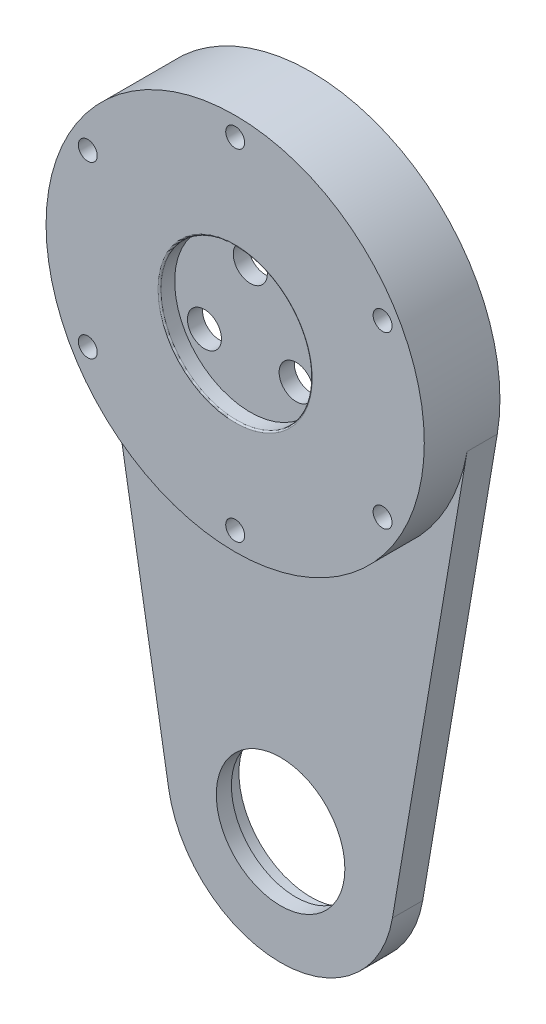
ISO-10303-21;
HEADER;
FILE_DESCRIPTION(('STEP AP214'),'2;1');
FILE_NAME('part.step','',(''),(''),'','','');
FILE_SCHEMA(('AUTOMOTIVE_DESIGN { 1 0 10303 214 1 1 1 1 }'));
ENDSEC;
DATA;
#1=APPLICATION_CONTEXT('core data for automotive mechanical design processes');
#2=APPLICATION_PROTOCOL_DEFINITION('international standard','automotive_design',2000,#1);
#3=PRODUCT_CONTEXT('',#1,'mechanical');
#4=PRODUCT('Part','Part','',(#3));
#5=PRODUCT_RELATED_PRODUCT_CATEGORY('part','',(#4));
#6=PRODUCT_DEFINITION_FORMATION('','',#4);
#7=PRODUCT_DEFINITION_CONTEXT('part definition',#1,'design');
#8=PRODUCT_DEFINITION('design','',#6,#7);
#9=PRODUCT_DEFINITION_SHAPE('','',#8);
#10=(LENGTH_UNIT() NAMED_UNIT(*) SI_UNIT(.MILLI.,.METRE.));
#11=(NAMED_UNIT(*) PLANE_ANGLE_UNIT() SI_UNIT($,.RADIAN.));
#12=(NAMED_UNIT(*) SI_UNIT($,.STERADIAN.) SOLID_ANGLE_UNIT());
#13=UNCERTAINTY_MEASURE_WITH_UNIT(LENGTH_MEASURE(1.E-05),#10,'distance_accuracy_value','');
#14=(GEOMETRIC_REPRESENTATION_CONTEXT(3) GLOBAL_UNCERTAINTY_ASSIGNED_CONTEXT((#13)) GLOBAL_UNIT_ASSIGNED_CONTEXT((#10,
#11,#12)) REPRESENTATION_CONTEXT('',''));
#15=CARTESIAN_POINT('',(0.,0.,0.));
#16=DIRECTION('',(0.,0.,1.));
#17=DIRECTION('',(1.,0.,0.));
#18=AXIS2_PLACEMENT_3D('',#15,#16,#17);
#19=CARTESIAN_POINT('',(-35.5676389386564,-176.5,-10.));
#20=DIRECTION('',(0.,0.,1.));
#21=DIRECTION('',(1.,0.,0.));
#22=AXIS2_PLACEMENT_3D('',#19,#20,#21);
#23=PLANE('',#22);
#24=CARTESIAN_POINT('',(-19.4855715851498,11.2500000000002,-10.));
#25=DIRECTION('',(0.,0.,-1.));
#26=DIRECTION('',(-1.,0.,0.));
#27=AXIS2_PLACEMENT_3D('',#24,#25,#26);
#28=CIRCLE('',#27,1.24999999999997);
#29=CARTESIAN_POINT('',(-20.7355715851497,11.2500000000002,-10.));
#30=VERTEX_POINT('',#29);
#31=EDGE_CURVE('E515',#30,#30,#28,.T.);
#32=ORIENTED_EDGE('',*,*,#31,.F.);
#33=EDGE_LOOP('',(#32));
#34=FACE_BOUND('',#33,.T.);
#35=CARTESIAN_POINT('',(-19.48557158515,-11.2499999999998,-10.));
#36=DIRECTION('',(0.,0.,-1.));
#37=DIRECTION('',(-1.,0.,0.));
#38=AXIS2_PLACEMENT_3D('',#35,#36,#37);
#39=CIRCLE('',#38,1.24999999999997);
#40=CARTESIAN_POINT('',(-20.73557158515,-11.2499999999998,-10.));
#41=VERTEX_POINT('',#40);
#42=EDGE_CURVE('E520',#41,#41,#39,.T.);
#43=ORIENTED_EDGE('',*,*,#42,.F.);
#44=EDGE_LOOP('',(#43));
#45=FACE_BOUND('',#44,.T.);
#46=CARTESIAN_POINT('',(19.4855715851499,11.25,-10.));
#47=DIRECTION('',(0.,0.,-1.));
#48=DIRECTION('',(-1.,0.,0.));
#49=AXIS2_PLACEMENT_3D('',#46,#47,#48);
#50=CIRCLE('',#49,1.24999999999997);
#51=CARTESIAN_POINT('',(18.2355715851499,11.25,-10.));
#52=VERTEX_POINT('',#51);
#53=EDGE_CURVE('E544',#52,#52,#50,.T.);
#54=ORIENTED_EDGE('',*,*,#53,.F.);
#55=EDGE_LOOP('',(#54));
#56=FACE_BOUND('',#55,.T.);
#57=CARTESIAN_POINT('',(0.,22.5,-10.));
#58=DIRECTION('',(0.,0.,-1.));
#59=DIRECTION('',(-1.,0.,0.));
#60=AXIS2_PLACEMENT_3D('',#57,#58,#59);
#61=CIRCLE('',#60,1.24999999999997);
#62=CARTESIAN_POINT('',(-1.24999999999997,22.5,-10.));
#63=VERTEX_POINT('',#62);
#64=EDGE_CURVE('E551',#63,#63,#61,.T.);
#65=ORIENTED_EDGE('',*,*,#64,.F.);
#66=EDGE_LOOP('',(#65));
#67=FACE_BOUND('',#66,.T.);
#68=DIRECTION('',(-0.166666666666667,-0.986013297183269,0.));
#69=VECTOR('',#68,1.);
#70=CARTESIAN_POINT('',(24.6503324295817,-4.16666666666667,-10.));
#71=LINE('',#70,#69);
#72=CARTESIAN_POINT('',(24.6503324295817,-4.16666666666667,-10.));
#73=VERTEX_POINT('',#72);
#74=CARTESIAN_POINT('',(14.790199457749,-62.5,-10.));
#75=VERTEX_POINT('',#74);
#76=EDGE_CURVE('E83',#73,#75,#71,.T.);
#77=ORIENTED_EDGE('',*,*,#76,.T.);
#78=CARTESIAN_POINT('',(0.,-60.,-10.));
#79=DIRECTION('',(0.,0.,1.));
#80=DIRECTION('',(1.,0.,0.));
#81=AXIS2_PLACEMENT_3D('',#78,#79,#80);
#82=CIRCLE('',#81,15.);
#83=CARTESIAN_POINT('',(-14.790199457749,-62.5,-10.));
#84=VERTEX_POINT('',#83);
#85=EDGE_CURVE('E86',#75,#84,#82,.F.);
#86=ORIENTED_EDGE('',*,*,#85,.T.);
#87=DIRECTION('',(-0.166666666666667,0.986013297183269,0.));
#88=VECTOR('',#87,1.);
#89=CARTESIAN_POINT('',(-24.6503324295817,-4.16666666666667,-10.));
#90=LINE('',#89,#88);
#91=CARTESIAN_POINT('',(-24.6503324295817,-4.16666666666667,-10.));
#92=VERTEX_POINT('',#91);
#93=EDGE_CURVE('E102',#84,#92,#90,.T.);
#94=ORIENTED_EDGE('',*,*,#93,.T.);
#95=CARTESIAN_POINT('',(0.,0.,-10.));
#96=DIRECTION('',(0.,0.,1.));
#97=DIRECTION('',(1.,0.,0.));
#98=AXIS2_PLACEMENT_3D('',#95,#96,#97);
#99=CIRCLE('',#98,25.);
#100=EDGE_CURVE('E58',#73,#92,#99,.T.);
#101=ORIENTED_EDGE('',*,*,#100,.F.);
#102=EDGE_LOOP('',(#77,#86,#94,#101));
#103=FACE_BOUND('',#102,.T.);
#104=CARTESIAN_POINT('',(0.,-60.,-10.));
#105=DIRECTION('',(0.,0.,1.));
#106=DIRECTION('',(1.,0.,0.));
#107=AXIS2_PLACEMENT_3D('',#104,#105,#106);
#108=CIRCLE('',#107,9.5);
#109=CARTESIAN_POINT('',(9.49999999999999,-60.,-10.));
#110=VERTEX_POINT('',#109);
#111=EDGE_CURVE('E92',#110,#110,#108,.F.);
#112=ORIENTED_EDGE('',*,*,#111,.F.);
#113=EDGE_LOOP('',(#112));
#114=FACE_BOUND('',#113,.T.);
#115=CARTESIAN_POINT('',(0.,0.,-10.));
#116=DIRECTION('',(0.,0.,1.));
#117=DIRECTION('',(1.,0.,0.));
#118=AXIS2_PLACEMENT_3D('',#115,#116,#117);
#119=CIRCLE('',#118,18.5);
#120=CARTESIAN_POINT('',(18.5,0.,-10.));
#121=VERTEX_POINT('',#120);
#122=EDGE_CURVE('E219',#121,#121,#119,.F.);
#123=ORIENTED_EDGE('',*,*,#122,.F.);
#124=EDGE_LOOP('',(#123));
#125=FACE_BOUND('',#124,.T.);
#126=CARTESIAN_POINT('',(19.4855715851498,-11.2500000000001,-10.));
#127=DIRECTION('',(0.,0.,-1.));
#128=DIRECTION('',(-1.,0.,0.));
#129=AXIS2_PLACEMENT_3D('',#126,#127,#128);
#130=CIRCLE('',#129,1.24999999999997);
#131=CARTESIAN_POINT('',(18.2355715851499,-11.2500000000001,-10.));
#132=VERTEX_POINT('',#131);
#133=EDGE_CURVE('E536',#132,#132,#130,.T.);
#134=ORIENTED_EDGE('',*,*,#133,.F.);
#135=EDGE_LOOP('',(#134));
#136=FACE_BOUND('',#135,.T.);
#137=CARTESIAN_POINT('',(0.,-22.5,-10.));
#138=DIRECTION('',(0.,0.,-1.));
#139=DIRECTION('',(-1.,0.,0.));
#140=AXIS2_PLACEMENT_3D('',#137,#138,#139);
#141=CIRCLE('',#140,1.24999999999997);
#142=CARTESIAN_POINT('',(-1.24999999999997,-22.5,-10.));
#143=VERTEX_POINT('',#142);
#144=EDGE_CURVE('E532',#143,#143,#141,.T.);
#145=ORIENTED_EDGE('',*,*,#144,.F.);
#146=EDGE_LOOP('',(#145));
#147=FACE_BOUND('',#146,.T.);
#148=ADVANCED_FACE('F41',(#34,#45,#56,#67,#103,#114,#125,#136,#147),#23,.F.);
#149=CARTESIAN_POINT('',(0.,-60.,-13.));
#150=DIRECTION('',(0.,0.,1.));
#151=DIRECTION('',(1.,0.,0.));
#152=AXIS2_PLACEMENT_3D('',#149,#150,#151);
#153=CYLINDRICAL_SURFACE('',#152,9.5);
#154=ORIENTED_EDGE('',*,*,#111,.T.);
#155=EDGE_LOOP('',(#154));
#156=FACE_BOUND('',#155,.T.);
#157=CARTESIAN_POINT('',(0.,-60.,-8.));
#158=DIRECTION('',(0.,0.,1.));
#159=DIRECTION('',(1.,0.,0.));
#160=AXIS2_PLACEMENT_3D('',#157,#158,#159);
#161=CIRCLE('',#160,9.5);
#162=CARTESIAN_POINT('',(9.49999999999999,-60.,-8.));
#163=VERTEX_POINT('',#162);
#164=EDGE_CURVE('E11',#163,#163,#161,.F.);
#165=ORIENTED_EDGE('',*,*,#164,.F.);
#166=EDGE_LOOP('',(#165));
#167=FACE_BOUND('',#166,.T.);
#168=ADVANCED_FACE('F259',(#156,#167),#153,.F.);
#169=CARTESIAN_POINT('',(0.,0.,-5.));
#170=DIRECTION('',(0.,0.,-1.));
#171=DIRECTION('',(-1.,0.,0.));
#172=AXIS2_PLACEMENT_3D('',#169,#170,#171);
#173=PLANE('',#172);
#174=CARTESIAN_POINT('',(0.,7.,-5.));
#175=DIRECTION('',(0.,0.,-1.));
#176=DIRECTION('',(-1.,0.,0.));
#177=AXIS2_PLACEMENT_3D('',#174,#175,#176);
#178=CIRCLE('',#177,3.99999999999999);
#179=CARTESIAN_POINT('',(-3.99999999999999,7.,-5.));
#180=VERTEX_POINT('',#179);
#181=EDGE_CURVE('E148',#180,#180,#178,.T.);
#182=ORIENTED_EDGE('',*,*,#181,.F.);
#183=EDGE_LOOP('',(#182));
#184=FACE_BOUND('',#183,.T.);
#185=CARTESIAN_POINT('',(-6.06217782649106,-3.50000000000003,-5.));
#186=DIRECTION('',(0.,0.,-1.));
#187=DIRECTION('',(-1.,0.,0.));
#188=AXIS2_PLACEMENT_3D('',#185,#186,#187);
#189=CIRCLE('',#188,3.99999999999999);
#190=CARTESIAN_POINT('',(-10.062177826491,-3.50000000000003,-5.));
#191=VERTEX_POINT('',#190);
#192=EDGE_CURVE('E135',#191,#191,#189,.T.);
#193=ORIENTED_EDGE('',*,*,#192,.F.);
#194=EDGE_LOOP('',(#193));
#195=FACE_BOUND('',#194,.T.);
#196=CARTESIAN_POINT('',(6.0621778264911,-3.49999999999994,-5.));
#197=DIRECTION('',(0.,0.,-1.));
#198=DIRECTION('',(-1.,0.,0.));
#199=AXIS2_PLACEMENT_3D('',#196,#197,#198);
#200=CIRCLE('',#199,3.99999999999999);
#201=CARTESIAN_POINT('',(2.06217782649111,-3.49999999999994,-5.));
#202=VERTEX_POINT('',#201);
#203=EDGE_CURVE('E122',#202,#202,#200,.T.);
#204=ORIENTED_EDGE('',*,*,#203,.F.);
#205=EDGE_LOOP('',(#204));
#206=FACE_BOUND('',#205,.T.);
#207=CARTESIAN_POINT('',(0.,0.,-5.));
#208=DIRECTION('',(0.,0.,-1.));
#209=DIRECTION('',(-1.,0.,0.));
#210=AXIS2_PLACEMENT_3D('',#207,#208,#209);
#211=CIRCLE('',#210,17.5);
#212=CARTESIAN_POINT('',(-17.5,0.,-5.));
#213=VERTEX_POINT('',#212);
#214=EDGE_CURVE('E177',#213,#213,#211,.F.);
#215=ORIENTED_EDGE('',*,*,#214,.F.);
#216=EDGE_LOOP('',(#215));
#217=FACE_BOUND('',#216,.T.);
#218=ADVANCED_FACE('F265',(#184,#195,#206,#217),#173,.T.);
#219=CARTESIAN_POINT('',(0.,0.,-4.));
#220=DIRECTION('',(0.,0.,1.));
#221=DIRECTION('',(1.,0.,0.));
#222=AXIS2_PLACEMENT_3D('',#219,#220,#221);
#223=CYLINDRICAL_SURFACE('',#222,25.);
#224=CARTESIAN_POINT('',(0.,0.,0.));
#225=DIRECTION('',(0.,0.,-1.));
#226=DIRECTION('',(-1.,0.,0.));
#227=AXIS2_PLACEMENT_3D('',#224,#225,#226);
#228=CIRCLE('',#227,25.);
#229=CARTESIAN_POINT('',(-25.,0.,0.));
#230=VERTEX_POINT('',#229);
#231=EDGE_CURVE('E165',#230,#230,#228,.T.);
#232=ORIENTED_EDGE('',*,*,#231,.T.);
#233=EDGE_LOOP('',(#232));
#234=FACE_BOUND('',#233,.T.);
#235=DIRECTION('',(0.,0.,-1.));
#236=VECTOR('',#235,1.);
#237=CARTESIAN_POINT('',(24.6503324295817,-4.16666666666667,-6.));
#238=LINE('',#237,#236);
#239=CARTESIAN_POINT('',(24.6503324295817,-4.16666666666667,-6.));
#240=VERTEX_POINT('',#239);
#241=EDGE_CURVE('E108',#240,#73,#238,.T.);
#242=ORIENTED_EDGE('',*,*,#241,.T.);
#243=ORIENTED_EDGE('',*,*,#100,.T.);
#244=DIRECTION('',(0.,0.,-1.));
#245=VECTOR('',#244,1.);
#246=CARTESIAN_POINT('',(-24.6503324295817,-4.16666666666667,-6.));
#247=LINE('',#246,#245);
#248=CARTESIAN_POINT('',(-24.6503324295817,-4.16666666666667,-6.));
#249=VERTEX_POINT('',#248);
#250=EDGE_CURVE('E112',#249,#92,#247,.T.);
#251=ORIENTED_EDGE('',*,*,#250,.F.);
#252=CARTESIAN_POINT('',(0.,0.,-6.));
#253=DIRECTION('',(0.,0.,1.));
#254=DIRECTION('',(-1.,0.,0.));
#255=AXIS2_PLACEMENT_3D('',#252,#253,#254);
#256=CIRCLE('',#255,25.);
#257=EDGE_CURVE('E66',#249,#240,#256,.T.);
#258=ORIENTED_EDGE('',*,*,#257,.T.);
#259=EDGE_LOOP('',(#242,#243,#251,#258));
#260=FACE_BOUND('',#259,.T.);
#261=ADVANCED_FACE('F237',(#234,#260),#223,.T.);
#262=CARTESIAN_POINT('',(0.,0.,0.));
#263=DIRECTION('',(0.,0.,-1.));
#264=DIRECTION('',(-1.,0.,0.));
#265=AXIS2_PLACEMENT_3D('',#262,#263,#264);
#266=PLANE('',#265);
#267=CARTESIAN_POINT('',(-19.4855715851498,11.2500000000002,0.));
#268=DIRECTION('',(0.,0.,-1.));
#269=DIRECTION('',(-1.,0.,0.));
#270=AXIS2_PLACEMENT_3D('',#267,#268,#269);
#271=CIRCLE('',#270,1.24999999999996);
#272=CARTESIAN_POINT('',(-20.7355715851497,11.2500000000002,0.));
#273=VERTEX_POINT('',#272);
#274=EDGE_CURVE('E518',#273,#273,#271,.T.);
#275=ORIENTED_EDGE('',*,*,#274,.T.);
#276=EDGE_LOOP('',(#275));
#277=FACE_BOUND('',#276,.T.);
#278=CARTESIAN_POINT('',(-19.48557158515,-11.2499999999998,0.));
#279=DIRECTION('',(0.,0.,-1.));
#280=DIRECTION('',(-1.,0.,0.));
#281=AXIS2_PLACEMENT_3D('',#278,#279,#280);
#282=CIRCLE('',#281,1.24999999999996);
#283=CARTESIAN_POINT('',(-20.7355715851499,-11.2499999999998,0.));
#284=VERTEX_POINT('',#283);
#285=EDGE_CURVE('E525',#284,#284,#282,.T.);
#286=ORIENTED_EDGE('',*,*,#285,.T.);
#287=EDGE_LOOP('',(#286));
#288=FACE_BOUND('',#287,.T.);
#289=CARTESIAN_POINT('',(0.,-22.5,0.));
#290=DIRECTION('',(0.,0.,-1.));
#291=DIRECTION('',(-1.,0.,0.));
#292=AXIS2_PLACEMENT_3D('',#289,#290,#291);
#293=CIRCLE('',#292,1.24999999999996);
#294=CARTESIAN_POINT('',(-1.24999999999996,-22.5,0.));
#295=VERTEX_POINT('',#294);
#296=EDGE_CURVE('E45',#295,#295,#293,.T.);
#297=ORIENTED_EDGE('',*,*,#296,.T.);
#298=EDGE_LOOP('',(#297));
#299=FACE_BOUND('',#298,.T.);
#300=CARTESIAN_POINT('',(19.4855715851498,-11.2500000000001,0.));
#301=DIRECTION('',(0.,0.,-1.));
#302=DIRECTION('',(-1.,0.,0.));
#303=AXIS2_PLACEMENT_3D('',#300,#301,#302);
#304=CIRCLE('',#303,1.24999999999996);
#305=CARTESIAN_POINT('',(18.2355715851499,-11.2500000000001,0.));
#306=VERTEX_POINT('',#305);
#307=EDGE_CURVE('E540',#306,#306,#304,.T.);
#308=ORIENTED_EDGE('',*,*,#307,.T.);
#309=EDGE_LOOP('',(#308));
#310=FACE_BOUND('',#309,.T.);
#311=CARTESIAN_POINT('',(19.4855715851499,11.25,0.));
#312=DIRECTION('',(0.,0.,-1.));
#313=DIRECTION('',(-1.,0.,0.));
#314=AXIS2_PLACEMENT_3D('',#311,#312,#313);
#315=CIRCLE('',#314,1.24999999999996);
#316=CARTESIAN_POINT('',(18.23557158515,11.25,0.));
#317=VERTEX_POINT('',#316);
#318=EDGE_CURVE('E548',#317,#317,#315,.T.);
#319=ORIENTED_EDGE('',*,*,#318,.T.);
#320=EDGE_LOOP('',(#319));
#321=FACE_BOUND('',#320,.T.);
#322=CARTESIAN_POINT('',(0.,22.5,0.));
#323=DIRECTION('',(0.,0.,-1.));
#324=DIRECTION('',(-1.,0.,0.));
#325=AXIS2_PLACEMENT_3D('',#322,#323,#324);
#326=CIRCLE('',#325,1.24999999999996);
#327=CARTESIAN_POINT('',(-1.24999999999996,22.5,0.));
#328=VERTEX_POINT('',#327);
#329=EDGE_CURVE('E210',#328,#328,#326,.T.);
#330=ORIENTED_EDGE('',*,*,#329,.T.);
#331=EDGE_LOOP('',(#330));
#332=FACE_BOUND('',#331,.T.);
#333=CARTESIAN_POINT('',(0.,0.,0.));
#334=DIRECTION('',(0.,0.,-1.));
#335=DIRECTION('',(-1.,0.,0.));
#336=AXIS2_PLACEMENT_3D('',#333,#334,#335);
#337=CIRCLE('',#336,10.2);
#338=CARTESIAN_POINT('',(-10.2,0.,0.));
#339=VERTEX_POINT('',#338);
#340=EDGE_CURVE('E173',#339,#339,#337,.T.);
#341=ORIENTED_EDGE('',*,*,#340,.T.);
#342=EDGE_LOOP('',(#341));
#343=FACE_BOUND('',#342,.T.);
#344=ORIENTED_EDGE('',*,*,#231,.F.);
#345=EDGE_LOOP('',(#344));
#346=FACE_BOUND('',#345,.T.);
#347=ADVANCED_FACE('F335',(#277,#288,#299,#310,#321,#332,#343,#346),#266,.F.);
#348=CARTESIAN_POINT('',(0.,0.,-2.));
#349=DIRECTION('',(0.,0.,1.));
#350=DIRECTION('',(1.,0.,0.));
#351=AXIS2_PLACEMENT_3D('',#348,#349,#350);
#352=CYLINDRICAL_SURFACE('',#351,10.);
#353=CARTESIAN_POINT('',(0.,0.,-0.2));
#354=DIRECTION('',(0.,0.,-1.));
#355=DIRECTION('',(-1.,0.,0.));
#356=AXIS2_PLACEMENT_3D('',#353,#354,#355);
#357=CIRCLE('',#356,10.);
#358=CARTESIAN_POINT('',(-10.,0.,-0.2));
#359=VERTEX_POINT('',#358);
#360=EDGE_CURVE('E169',#359,#359,#357,.F.);
#361=ORIENTED_EDGE('',*,*,#360,.T.);
#362=EDGE_LOOP('',(#361));
#363=FACE_BOUND('',#362,.T.);
#364=CARTESIAN_POINT('',(0.,0.,-2.));
#365=DIRECTION('',(0.,0.,1.));
#366=DIRECTION('',(1.,0.,0.));
#367=AXIS2_PLACEMENT_3D('',#364,#365,#366);
#368=CIRCLE('',#367,10.);
#369=CARTESIAN_POINT('',(10.,0.,-2.));
#370=VERTEX_POINT('',#369);
#371=EDGE_CURVE('E161',#370,#370,#368,.T.);
#372=ORIENTED_EDGE('',*,*,#371,.F.);
#373=EDGE_LOOP('',(#372));
#374=FACE_BOUND('',#373,.T.);
#375=ADVANCED_FACE('F331',(#363,#374),#352,.F.);
#376=CARTESIAN_POINT('',(0.,0.,-2.));
#377=DIRECTION('',(0.,0.,1.));
#378=DIRECTION('',(1.,0.,0.));
#379=AXIS2_PLACEMENT_3D('',#376,#377,#378);
#380=PLANE('',#379);
#381=CARTESIAN_POINT('',(6.0621778264911,-3.49999999999994,-2.));
#382=DIRECTION('',(0.,0.,1.));
#383=DIRECTION('',(1.,0.,0.));
#384=AXIS2_PLACEMENT_3D('',#381,#382,#383);
#385=CIRCLE('',#384,2.25);
#386=CARTESIAN_POINT('',(8.3121778264911,-3.49999999999994,-2.));
#387=VERTEX_POINT('',#386);
#388=EDGE_CURVE('E134',#387,#387,#385,.T.);
#389=ORIENTED_EDGE('',*,*,#388,.F.);
#390=EDGE_LOOP('',(#389));
#391=FACE_BOUND('',#390,.T.);
#392=CARTESIAN_POINT('',(-6.06217782649106,-3.50000000000003,-2.));
#393=DIRECTION('',(0.,0.,1.));
#394=DIRECTION('',(1.,0.,0.));
#395=AXIS2_PLACEMENT_3D('',#392,#393,#394);
#396=CIRCLE('',#395,2.25);
#397=CARTESIAN_POINT('',(-3.81217782649106,-3.50000000000003,-2.));
#398=VERTEX_POINT('',#397);
#399=EDGE_CURVE('E147',#398,#398,#396,.T.);
#400=ORIENTED_EDGE('',*,*,#399,.F.);
#401=EDGE_LOOP('',(#400));
#402=FACE_BOUND('',#401,.T.);
#403=CARTESIAN_POINT('',(0.,7.,-2.));
#404=DIRECTION('',(0.,0.,1.));
#405=DIRECTION('',(1.,0.,0.));
#406=AXIS2_PLACEMENT_3D('',#403,#404,#405);
#407=CIRCLE('',#406,2.25);
#408=CARTESIAN_POINT('',(2.25,7.,-2.));
#409=VERTEX_POINT('',#408);
#410=EDGE_CURVE('E160',#409,#409,#407,.T.);
#411=ORIENTED_EDGE('',*,*,#410,.F.);
#412=EDGE_LOOP('',(#411));
#413=FACE_BOUND('',#412,.T.);
#414=ORIENTED_EDGE('',*,*,#371,.T.);
#415=EDGE_LOOP('',(#414));
#416=FACE_BOUND('',#415,.T.);
#417=ADVANCED_FACE('F328',(#391,#402,#413,#416),#380,.T.);
#418=CARTESIAN_POINT('',(0.,0.,-0.2));
#419=DIRECTION('',(0.,0.,-1.));
#420=DIRECTION('',(-1.,0.,0.));
#421=AXIS2_PLACEMENT_3D('',#418,#419,#420);
#422=TOROIDAL_SURFACE('',#421,10.2,0.2);
#423=ORIENTED_EDGE('',*,*,#340,.F.);
#424=EDGE_LOOP('',(#423));
#425=FACE_BOUND('',#424,.T.);
#426=ORIENTED_EDGE('',*,*,#360,.F.);
#427=EDGE_LOOP('',(#426));
#428=FACE_BOUND('',#427,.T.);
#429=ADVANCED_FACE('F326',(#425,#428),#422,.T.);
#430=CARTESIAN_POINT('',(0.,0.,-5.));
#431=DIRECTION('',(0.,0.,-1.));
#432=DIRECTION('',(-1.,0.,0.));
#433=AXIS2_PLACEMENT_3D('',#430,#431,#432);
#434=CYLINDRICAL_SURFACE('',#433,18.5);
#435=ORIENTED_EDGE('',*,*,#122,.T.);
#436=EDGE_LOOP('',(#435));
#437=FACE_BOUND('',#436,.T.);
#438=CARTESIAN_POINT('',(0.,0.,-6.3));
#439=DIRECTION('',(0.,0.,-1.));
#440=DIRECTION('',(-1.,0.,0.));
#441=AXIS2_PLACEMENT_3D('',#438,#439,#440);
#442=CIRCLE('',#441,18.5);
#443=CARTESIAN_POINT('',(-18.5,0.,-6.3));
#444=VERTEX_POINT('',#443);
#445=EDGE_CURVE('E51',#444,#444,#442,.F.);
#446=ORIENTED_EDGE('',*,*,#445,.T.);
#447=EDGE_LOOP('',(#446));
#448=FACE_BOUND('',#447,.T.);
#449=ADVANCED_FACE('F319',(#437,#448),#434,.F.);
#450=CARTESIAN_POINT('',(0.,7.,-5.));
#451=DIRECTION('',(0.,0.,-1.));
#452=DIRECTION('',(-1.,0.,0.));
#453=AXIS2_PLACEMENT_3D('',#450,#451,#452);
#454=CYLINDRICAL_SURFACE('',#453,2.25);
#455=ORIENTED_EDGE('',*,*,#410,.T.);
#456=EDGE_LOOP('',(#455));
#457=FACE_BOUND('',#456,.T.);
#458=CARTESIAN_POINT('',(0.,7.,-4.));
#459=DIRECTION('',(0.,0.,-1.));
#460=DIRECTION('',(-1.,0.,0.));
#461=AXIS2_PLACEMENT_3D('',#458,#459,#460);
#462=CIRCLE('',#461,2.25);
#463=CARTESIAN_POINT('',(-2.25,7.,-4.));
#464=VERTEX_POINT('',#463);
#465=EDGE_CURVE('E156',#464,#464,#462,.T.);
#466=ORIENTED_EDGE('',*,*,#465,.T.);
#467=EDGE_LOOP('',(#466));
#468=FACE_BOUND('',#467,.T.);
#469=ADVANCED_FACE('F315',(#457,#468),#454,.F.);
#470=CARTESIAN_POINT('',(2.25,7.,-4.));
#471=DIRECTION('',(0.,0.,1.));
#472=DIRECTION('',(1.,0.,0.));
#473=AXIS2_PLACEMENT_3D('',#470,#471,#472);
#474=PLANE('',#473);
#475=ORIENTED_EDGE('',*,*,#465,.F.);
#476=EDGE_LOOP('',(#475));
#477=FACE_BOUND('',#476,.T.);
#478=CARTESIAN_POINT('',(0.,7.,-4.));
#479=DIRECTION('',(0.,0.,-1.));
#480=DIRECTION('',(-1.,0.,0.));
#481=AXIS2_PLACEMENT_3D('',#478,#479,#480);
#482=CIRCLE('',#481,4.);
#483=CARTESIAN_POINT('',(-4.,7.,-4.));
#484=VERTEX_POINT('',#483);
#485=EDGE_CURVE('E152',#484,#484,#482,.T.);
#486=ORIENTED_EDGE('',*,*,#485,.T.);
#487=EDGE_LOOP('',(#486));
#488=FACE_BOUND('',#487,.T.);
#489=ADVANCED_FACE('F311',(#477,#488),#474,.F.);
#490=CARTESIAN_POINT('',(0.,7.,-5.));
#491=DIRECTION('',(0.,0.,-1.));
#492=DIRECTION('',(-1.,0.,0.));
#493=AXIS2_PLACEMENT_3D('',#490,#491,#492);
#494=CYLINDRICAL_SURFACE('',#493,4.);
#495=ORIENTED_EDGE('',*,*,#485,.F.);
#496=EDGE_LOOP('',(#495));
#497=FACE_BOUND('',#496,.T.);
#498=ORIENTED_EDGE('',*,*,#181,.T.);
#499=EDGE_LOOP('',(#498));
#500=FACE_BOUND('',#499,.T.);
#501=ADVANCED_FACE('F307',(#497,#500),#494,.F.);
#502=CARTESIAN_POINT('',(-6.06217782649106,-3.50000000000003,-5.));
#503=DIRECTION('',(0.,0.,-1.));
#504=DIRECTION('',(-1.,0.,0.));
#505=AXIS2_PLACEMENT_3D('',#502,#503,#504);
#506=CYLINDRICAL_SURFACE('',#505,2.25);
#507=ORIENTED_EDGE('',*,*,#399,.T.);
#508=EDGE_LOOP('',(#507));
#509=FACE_BOUND('',#508,.T.);
#510=CARTESIAN_POINT('',(-6.06217782649106,-3.50000000000003,-4.));
#511=DIRECTION('',(0.,0.,-1.));
#512=DIRECTION('',(-1.,0.,0.));
#513=AXIS2_PLACEMENT_3D('',#510,#511,#512);
#514=CIRCLE('',#513,2.25);
#515=CARTESIAN_POINT('',(-8.31217782649106,-3.50000000000003,-4.));
#516=VERTEX_POINT('',#515);
#517=EDGE_CURVE('E143',#516,#516,#514,.T.);
#518=ORIENTED_EDGE('',*,*,#517,.T.);
#519=EDGE_LOOP('',(#518));
#520=FACE_BOUND('',#519,.T.);
#521=ADVANCED_FACE('F303',(#509,#520),#506,.F.);
#522=CARTESIAN_POINT('',(-3.81217782649105,-3.50000000000003,-4.));
#523=DIRECTION('',(0.,0.,1.));
#524=DIRECTION('',(1.,0.,0.));
#525=AXIS2_PLACEMENT_3D('',#522,#523,#524);
#526=PLANE('',#525);
#527=ORIENTED_EDGE('',*,*,#517,.F.);
#528=EDGE_LOOP('',(#527));
#529=FACE_BOUND('',#528,.T.);
#530=CARTESIAN_POINT('',(-6.06217782649106,-3.50000000000003,-4.));
#531=DIRECTION('',(0.,0.,-1.));
#532=DIRECTION('',(-1.,0.,0.));
#533=AXIS2_PLACEMENT_3D('',#530,#531,#532);
#534=CIRCLE('',#533,4.);
#535=CARTESIAN_POINT('',(-10.0621778264911,-3.50000000000003,-4.));
#536=VERTEX_POINT('',#535);
#537=EDGE_CURVE('E139',#536,#536,#534,.T.);
#538=ORIENTED_EDGE('',*,*,#537,.T.);
#539=EDGE_LOOP('',(#538));
#540=FACE_BOUND('',#539,.T.);
#541=ADVANCED_FACE('F299',(#529,#540),#526,.F.);
#542=CARTESIAN_POINT('',(-6.06217782649106,-3.50000000000003,-5.));
#543=DIRECTION('',(0.,0.,-1.));
#544=DIRECTION('',(-1.,0.,0.));
#545=AXIS2_PLACEMENT_3D('',#542,#543,#544);
#546=CYLINDRICAL_SURFACE('',#545,4.);
#547=ORIENTED_EDGE('',*,*,#537,.F.);
#548=EDGE_LOOP('',(#547));
#549=FACE_BOUND('',#548,.T.);
#550=ORIENTED_EDGE('',*,*,#192,.T.);
#551=EDGE_LOOP('',(#550));
#552=FACE_BOUND('',#551,.T.);
#553=ADVANCED_FACE('F295',(#549,#552),#546,.F.);
#554=CARTESIAN_POINT('',(6.0621778264911,-3.49999999999994,-5.));
#555=DIRECTION('',(0.,0.,-1.));
#556=DIRECTION('',(-1.,0.,0.));
#557=AXIS2_PLACEMENT_3D('',#554,#555,#556);
#558=CYLINDRICAL_SURFACE('',#557,2.25);
#559=ORIENTED_EDGE('',*,*,#388,.T.);
#560=EDGE_LOOP('',(#559));
#561=FACE_BOUND('',#560,.T.);
#562=CARTESIAN_POINT('',(6.0621778264911,-3.49999999999994,-4.));
#563=DIRECTION('',(0.,0.,-1.));
#564=DIRECTION('',(-1.,0.,0.));
#565=AXIS2_PLACEMENT_3D('',#562,#563,#564);
#566=CIRCLE('',#565,2.25);
#567=CARTESIAN_POINT('',(3.8121778264911,-3.49999999999994,-4.));
#568=VERTEX_POINT('',#567);
#569=EDGE_CURVE('E130',#568,#568,#566,.T.);
#570=ORIENTED_EDGE('',*,*,#569,.T.);
#571=EDGE_LOOP('',(#570));
#572=FACE_BOUND('',#571,.T.);
#573=ADVANCED_FACE('F291',(#561,#572),#558,.F.);
#574=CARTESIAN_POINT('',(8.3121778264911,-3.49999999999994,-4.));
#575=DIRECTION('',(0.,0.,1.));
#576=DIRECTION('',(1.,0.,0.));
#577=AXIS2_PLACEMENT_3D('',#574,#575,#576);
#578=PLANE('',#577);
#579=ORIENTED_EDGE('',*,*,#569,.F.);
#580=EDGE_LOOP('',(#579));
#581=FACE_BOUND('',#580,.T.);
#582=CARTESIAN_POINT('',(6.0621778264911,-3.49999999999994,-4.));
#583=DIRECTION('',(0.,0.,-1.));
#584=DIRECTION('',(-1.,0.,0.));
#585=AXIS2_PLACEMENT_3D('',#582,#583,#584);
#586=CIRCLE('',#585,4.);
#587=CARTESIAN_POINT('',(2.0621778264911,-3.49999999999994,-4.));
#588=VERTEX_POINT('',#587);
#589=EDGE_CURVE('E126',#588,#588,#586,.T.);
#590=ORIENTED_EDGE('',*,*,#589,.T.);
#591=EDGE_LOOP('',(#590));
#592=FACE_BOUND('',#591,.T.);
#593=ADVANCED_FACE('F287',(#581,#592),#578,.F.);
#594=CARTESIAN_POINT('',(6.0621778264911,-3.49999999999994,-5.));
#595=DIRECTION('',(0.,0.,-1.));
#596=DIRECTION('',(-1.,0.,0.));
#597=AXIS2_PLACEMENT_3D('',#594,#595,#596);
#598=CYLINDRICAL_SURFACE('',#597,4.);
#599=ORIENTED_EDGE('',*,*,#589,.F.);
#600=EDGE_LOOP('',(#599));
#601=FACE_BOUND('',#600,.T.);
#602=ORIENTED_EDGE('',*,*,#203,.T.);
#603=EDGE_LOOP('',(#602));
#604=FACE_BOUND('',#603,.T.);
#605=ADVANCED_FACE('F283',(#601,#604),#598,.F.);
#606=CARTESIAN_POINT('',(0.,0.,-6.));
#607=DIRECTION('',(0.,0.,-1.));
#608=DIRECTION('',(-1.,0.,0.));
#609=AXIS2_PLACEMENT_3D('',#606,#607,#608);
#610=PLANE('',#609);
#611=CARTESIAN_POINT('',(0.,0.,-6.));
#612=DIRECTION('',(0.,0.,-1.));
#613=DIRECTION('',(-1.,0.,0.));
#614=AXIS2_PLACEMENT_3D('',#611,#612,#613);
#615=CIRCLE('',#614,18.2);
#616=CARTESIAN_POINT('',(-18.2,0.,-6.));
#617=VERTEX_POINT('',#616);
#618=EDGE_CURVE('E190',#617,#617,#615,.T.);
#619=ORIENTED_EDGE('',*,*,#618,.T.);
#620=EDGE_LOOP('',(#619));
#621=FACE_BOUND('',#620,.T.);
#622=CARTESIAN_POINT('',(0.,0.,-6.));
#623=DIRECTION('',(0.,0.,-1.));
#624=DIRECTION('',(-1.,0.,0.));
#625=AXIS2_PLACEMENT_3D('',#622,#623,#624);
#626=CIRCLE('',#625,17.5);
#627=CARTESIAN_POINT('',(-17.5,0.,-6.));
#628=VERTEX_POINT('',#627);
#629=EDGE_CURVE('E118',#628,#628,#626,.T.);
#630=ORIENTED_EDGE('',*,*,#629,.F.);
#631=EDGE_LOOP('',(#630));
#632=FACE_BOUND('',#631,.T.);
#633=ADVANCED_FACE('F279',(#621,#632),#610,.T.);
#634=CARTESIAN_POINT('',(0.,0.,-6.));
#635=DIRECTION('',(0.,0.,1.));
#636=DIRECTION('',(1.,0.,0.));
#637=AXIS2_PLACEMENT_3D('',#634,#635,#636);
#638=CYLINDRICAL_SURFACE('',#637,17.5);
#639=ORIENTED_EDGE('',*,*,#629,.T.);
#640=EDGE_LOOP('',(#639));
#641=FACE_BOUND('',#640,.T.);
#642=ORIENTED_EDGE('',*,*,#214,.T.);
#643=EDGE_LOOP('',(#642));
#644=FACE_BOUND('',#643,.T.);
#645=ADVANCED_FACE('F272',(#641,#644),#638,.F.);
#646=CARTESIAN_POINT('',(-24.6503324295817,-4.16666666666667,-6.));
#647=DIRECTION('',(-0.986013297183269,-0.166666666666667,0.));
#648=DIRECTION('',(0.166666666666667,-0.986013297183269,0.));
#649=AXIS2_PLACEMENT_3D('',#646,#647,#648);
#650=PLANE('',#649);
#651=ORIENTED_EDGE('',*,*,#93,.F.);
#652=DIRECTION('',(0.,0.,-1.));
#653=VECTOR('',#652,1.);
#654=CARTESIAN_POINT('',(-14.790199457749,-62.5,-6.));
#655=LINE('',#654,#653);
#656=CARTESIAN_POINT('',(-14.790199457749,-62.5,-6.));
#657=VERTEX_POINT('',#656);
#658=EDGE_CURVE('E100',#657,#84,#655,.T.);
#659=ORIENTED_EDGE('',*,*,#658,.F.);
#660=DIRECTION('',(-0.166666666666667,0.986013297183269,0.));
#661=VECTOR('',#660,1.);
#662=CARTESIAN_POINT('',(-24.6503324295817,-4.16666666666667,-6.));
#663=LINE('',#662,#661);
#664=EDGE_CURVE('E114',#657,#249,#663,.T.);
#665=ORIENTED_EDGE('',*,*,#664,.T.);
#666=ORIENTED_EDGE('',*,*,#250,.T.);
#667=EDGE_LOOP('',(#651,#659,#665,#666));
#668=FACE_BOUND('',#667,.T.);
#669=ADVANCED_FACE('F235',(#668),#650,.T.);
#670=CARTESIAN_POINT('',(0.,-60.,-6.));
#671=DIRECTION('',(0.,0.,-1.));
#672=DIRECTION('',(-1.,0.,0.));
#673=AXIS2_PLACEMENT_3D('',#670,#671,#672);
#674=CYLINDRICAL_SURFACE('',#673,15.);
#675=ORIENTED_EDGE('',*,*,#85,.F.);
#676=DIRECTION('',(0.,0.,-1.));
#677=VECTOR('',#676,1.);
#678=CARTESIAN_POINT('',(14.790199457749,-62.5,-6.));
#679=LINE('',#678,#677);
#680=CARTESIAN_POINT('',(14.790199457749,-62.5,-6.));
#681=VERTEX_POINT('',#680);
#682=EDGE_CURVE('E98',#681,#75,#679,.T.);
#683=ORIENTED_EDGE('',*,*,#682,.F.);
#684=CARTESIAN_POINT('',(0.,-60.,-6.));
#685=DIRECTION('',(0.,0.,-1.));
#686=DIRECTION('',(-1.,0.,0.));
#687=AXIS2_PLACEMENT_3D('',#684,#685,#686);
#688=CIRCLE('',#687,15.);
#689=EDGE_CURVE('E227',#681,#657,#688,.T.);
#690=ORIENTED_EDGE('',*,*,#689,.T.);
#691=ORIENTED_EDGE('',*,*,#658,.T.);
#692=EDGE_LOOP('',(#675,#683,#690,#691));
#693=FACE_BOUND('',#692,.T.);
#694=ADVANCED_FACE('F96',(#693),#674,.T.);
#695=CARTESIAN_POINT('',(24.6503324295817,-4.16666666666667,-6.));
#696=DIRECTION('',(0.986013297183269,-0.166666666666667,0.));
#697=DIRECTION('',(0.166666666666667,0.986013297183269,0.));
#698=AXIS2_PLACEMENT_3D('',#695,#696,#697);
#699=PLANE('',#698);
#700=ORIENTED_EDGE('',*,*,#76,.F.);
#701=ORIENTED_EDGE('',*,*,#241,.F.);
#702=DIRECTION('',(-0.166666666666667,-0.986013297183269,0.));
#703=VECTOR('',#702,1.);
#704=CARTESIAN_POINT('',(24.6503324295817,-4.16666666666667,-6.));
#705=LINE('',#704,#703);
#706=EDGE_CURVE('E106',#240,#681,#705,.T.);
#707=ORIENTED_EDGE('',*,*,#706,.T.);
#708=ORIENTED_EDGE('',*,*,#682,.T.);
#709=EDGE_LOOP('',(#700,#701,#707,#708));
#710=FACE_BOUND('',#709,.T.);
#711=ADVANCED_FACE('F105',(#710),#699,.T.);
#712=CARTESIAN_POINT('',(0.,0.,-6.));
#713=DIRECTION('',(0.,0.,-1.));
#714=DIRECTION('',(-1.,0.,0.));
#715=AXIS2_PLACEMENT_3D('',#712,#713,#714);
#716=PLANE('',#715);
#717=ORIENTED_EDGE('',*,*,#257,.F.);
#718=ORIENTED_EDGE('',*,*,#664,.F.);
#719=ORIENTED_EDGE('',*,*,#689,.F.);
#720=ORIENTED_EDGE('',*,*,#706,.F.);
#721=EDGE_LOOP('',(#717,#718,#719,#720));
#722=FACE_BOUND('',#721,.T.);
#723=CARTESIAN_POINT('',(0.,-60.,-6.));
#724=DIRECTION('',(0.,0.,1.));
#725=DIRECTION('',(1.,0.,0.));
#726=AXIS2_PLACEMENT_3D('',#723,#724,#725);
#727=CIRCLE('',#726,8.5);
#728=CARTESIAN_POINT('',(8.49999999999999,-60.,-6.));
#729=VERTEX_POINT('',#728);
#730=EDGE_CURVE('E204',#729,#729,#727,.T.);
#731=ORIENTED_EDGE('',*,*,#730,.F.);
#732=EDGE_LOOP('',(#731));
#733=FACE_BOUND('',#732,.T.);
#734=ADVANCED_FACE('F238',(#722,#733),#716,.F.);
#735=CARTESIAN_POINT('',(0.,0.,-6.3));
#736=DIRECTION('',(0.,0.,-1.));
#737=DIRECTION('',(-1.,0.,0.));
#738=AXIS2_PLACEMENT_3D('',#735,#736,#737);
#739=TOROIDAL_SURFACE('',#738,18.2,0.3);
#740=ORIENTED_EDGE('',*,*,#445,.F.);
#741=EDGE_LOOP('',(#740));
#742=FACE_BOUND('',#741,.T.);
#743=ORIENTED_EDGE('',*,*,#618,.F.);
#744=EDGE_LOOP('',(#743));
#745=FACE_BOUND('',#744,.T.);
#746=ADVANCED_FACE('F43',(#742,#745),#739,.F.);
#747=CARTESIAN_POINT('',(0.,-60.,-8.));
#748=DIRECTION('',(0.,0.,1.));
#749=DIRECTION('',(1.,0.,0.));
#750=AXIS2_PLACEMENT_3D('',#747,#748,#749);
#751=PLANE('',#750);
#752=CARTESIAN_POINT('',(0.,-60.,-8.));
#753=DIRECTION('',(0.,0.,1.));
#754=DIRECTION('',(1.,0.,0.));
#755=AXIS2_PLACEMENT_3D('',#752,#753,#754);
#756=CIRCLE('',#755,8.5);
#757=CARTESIAN_POINT('',(8.49999999999999,-60.,-8.));
#758=VERTEX_POINT('',#757);
#759=EDGE_CURVE('E199',#758,#758,#756,.T.);
#760=ORIENTED_EDGE('',*,*,#759,.T.);
#761=EDGE_LOOP('',(#760));
#762=FACE_BOUND('',#761,.T.);
#763=ORIENTED_EDGE('',*,*,#164,.T.);
#764=EDGE_LOOP('',(#763));
#765=FACE_BOUND('',#764,.T.);
#766=ADVANCED_FACE('F247',(#762,#765),#751,.F.);
#767=CARTESIAN_POINT('',(0.,-60.,-8.));
#768=DIRECTION('',(0.,0.,1.));
#769=DIRECTION('',(1.,0.,0.));
#770=AXIS2_PLACEMENT_3D('',#767,#768,#769);
#771=CYLINDRICAL_SURFACE('',#770,8.5);
#772=ORIENTED_EDGE('',*,*,#759,.F.);
#773=EDGE_LOOP('',(#772));
#774=FACE_BOUND('',#773,.T.);
#775=ORIENTED_EDGE('',*,*,#730,.T.);
#776=EDGE_LOOP('',(#775));
#777=FACE_BOUND('',#776,.T.);
#778=ADVANCED_FACE('F244',(#774,#777),#771,.F.);
#779=CARTESIAN_POINT('',(0.,22.5,-10.));
#780=DIRECTION('',(0.,0.,-1.));
#781=DIRECTION('',(-1.,0.,0.));
#782=AXIS2_PLACEMENT_3D('',#779,#780,#781);
#783=CYLINDRICAL_SURFACE('',#782,1.24999999999996);
#784=ORIENTED_EDGE('',*,*,#64,.T.);
#785=EDGE_LOOP('',(#784));
#786=FACE_BOUND('',#785,.T.);
#787=ORIENTED_EDGE('',*,*,#329,.F.);
#788=EDGE_LOOP('',(#787));
#789=FACE_BOUND('',#788,.T.);
#790=ADVANCED_FACE('F246',(#786,#789),#783,.F.);
#791=CARTESIAN_POINT('',(19.4855715851499,11.25,-10.));
#792=DIRECTION('',(0.,0.,-1.));
#793=DIRECTION('',(-1.,0.,0.));
#794=AXIS2_PLACEMENT_3D('',#791,#792,#793);
#795=CYLINDRICAL_SURFACE('',#794,1.24999999999996);
#796=ORIENTED_EDGE('',*,*,#53,.T.);
#797=EDGE_LOOP('',(#796));
#798=FACE_BOUND('',#797,.T.);
#799=ORIENTED_EDGE('',*,*,#318,.F.);
#800=EDGE_LOOP('',(#799));
#801=FACE_BOUND('',#800,.T.);
#802=ADVANCED_FACE('F254',(#798,#801),#795,.F.);
#803=CARTESIAN_POINT('',(19.4855715851498,-11.2500000000001,-10.));
#804=DIRECTION('',(0.,0.,-1.));
#805=DIRECTION('',(-1.,0.,0.));
#806=AXIS2_PLACEMENT_3D('',#803,#804,#805);
#807=CYLINDRICAL_SURFACE('',#806,1.24999999999996);
#808=ORIENTED_EDGE('',*,*,#133,.T.);
#809=EDGE_LOOP('',(#808));
#810=FACE_BOUND('',#809,.T.);
#811=ORIENTED_EDGE('',*,*,#307,.F.);
#812=EDGE_LOOP('',(#811));
#813=FACE_BOUND('',#812,.T.);
#814=ADVANCED_FACE('F469',(#810,#813),#807,.F.);
#815=CARTESIAN_POINT('',(0.,-22.5,-10.));
#816=DIRECTION('',(0.,0.,-1.));
#817=DIRECTION('',(-1.,0.,0.));
#818=AXIS2_PLACEMENT_3D('',#815,#816,#817);
#819=CYLINDRICAL_SURFACE('',#818,1.24999999999996);
#820=ORIENTED_EDGE('',*,*,#144,.T.);
#821=EDGE_LOOP('',(#820));
#822=FACE_BOUND('',#821,.T.);
#823=ORIENTED_EDGE('',*,*,#296,.F.);
#824=EDGE_LOOP('',(#823));
#825=FACE_BOUND('',#824,.T.);
#826=ADVANCED_FACE('F479',(#822,#825),#819,.F.);
#827=CARTESIAN_POINT('',(-19.48557158515,-11.2499999999998,-10.));
#828=DIRECTION('',(0.,0.,-1.));
#829=DIRECTION('',(-1.,0.,0.));
#830=AXIS2_PLACEMENT_3D('',#827,#828,#829);
#831=CYLINDRICAL_SURFACE('',#830,1.24999999999996);
#832=ORIENTED_EDGE('',*,*,#42,.T.);
#833=EDGE_LOOP('',(#832));
#834=FACE_BOUND('',#833,.T.);
#835=ORIENTED_EDGE('',*,*,#285,.F.);
#836=EDGE_LOOP('',(#835));
#837=FACE_BOUND('',#836,.T.);
#838=ADVANCED_FACE('F489',(#834,#837),#831,.F.);
#839=CARTESIAN_POINT('',(-19.4855715851498,11.2500000000002,-10.));
#840=DIRECTION('',(0.,0.,-1.));
#841=DIRECTION('',(-1.,0.,0.));
#842=AXIS2_PLACEMENT_3D('',#839,#840,#841);
#843=CYLINDRICAL_SURFACE('',#842,1.24999999999996);
#844=ORIENTED_EDGE('',*,*,#31,.T.);
#845=EDGE_LOOP('',(#844));
#846=FACE_BOUND('',#845,.T.);
#847=ORIENTED_EDGE('',*,*,#274,.F.);
#848=EDGE_LOOP('',(#847));
#849=FACE_BOUND('',#848,.T.);
#850=ADVANCED_FACE('F499',(#846,#849),#843,.F.);
#851=CLOSED_SHELL('',(#148,#168,#218,#261,#347,#375,#417,#429,#449,#469,#489,#501,#521,#541,
#553,#573,#593,#605,#633,#645,#669,#694,#711,#734,#746,#766,#778,#790,#802,#814,#826,#838,#850));
#852=MANIFOLD_SOLID_BREP('B2',#851);
#853=ADVANCED_BREP_SHAPE_REPRESENTATION('',(#18,#852),#14);
#854=SHAPE_DEFINITION_REPRESENTATION(#9,#853);
ENDSEC;
END-ISO-10303-21;
